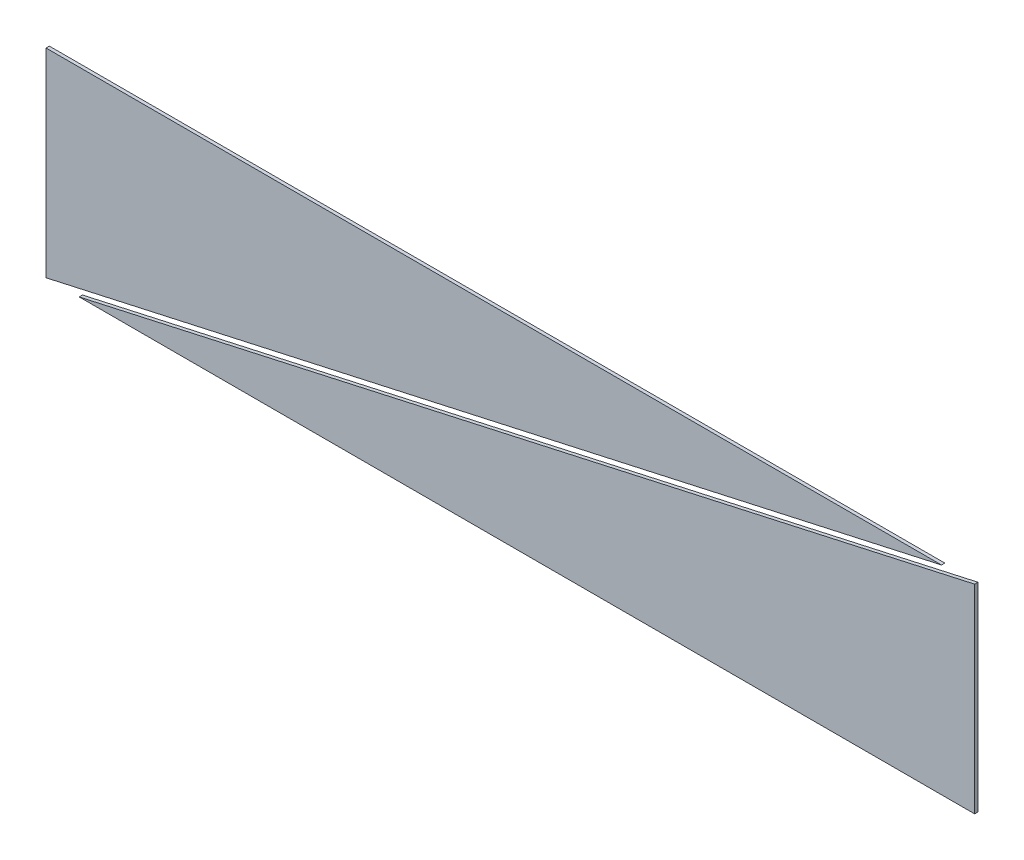
ISO-10303-21;
HEADER;
FILE_DESCRIPTION(('STEP AP214'),'2;1');
FILE_NAME('part.step','',(''),(''),'','','');
FILE_SCHEMA(('AUTOMOTIVE_DESIGN { 1 0 10303 214 1 1 1 1 }'));
ENDSEC;
DATA;
#1=APPLICATION_CONTEXT('core data for automotive mechanical design processes');
#2=APPLICATION_PROTOCOL_DEFINITION('international standard','automotive_design',2000,#1);
#3=PRODUCT_CONTEXT('',#1,'mechanical');
#4=PRODUCT('Part','Part','',(#3));
#5=PRODUCT_RELATED_PRODUCT_CATEGORY('part','',(#4));
#6=PRODUCT_DEFINITION_FORMATION('','',#4);
#7=PRODUCT_DEFINITION_CONTEXT('part definition',#1,'design');
#8=PRODUCT_DEFINITION('design','',#6,#7);
#9=PRODUCT_DEFINITION_SHAPE('','',#8);
#10=(LENGTH_UNIT() NAMED_UNIT(*) SI_UNIT(.MILLI.,.METRE.));
#11=(NAMED_UNIT(*) PLANE_ANGLE_UNIT() SI_UNIT($,.RADIAN.));
#12=(NAMED_UNIT(*) SI_UNIT($,.STERADIAN.) SOLID_ANGLE_UNIT());
#13=UNCERTAINTY_MEASURE_WITH_UNIT(LENGTH_MEASURE(1.E-05),#10,'distance_accuracy_value','');
#14=(GEOMETRIC_REPRESENTATION_CONTEXT(3) GLOBAL_UNCERTAINTY_ASSIGNED_CONTEXT((#13)) GLOBAL_UNIT_ASSIGNED_CONTEXT((#10,
#11,#12)) REPRESENTATION_CONTEXT('',''));
#15=CARTESIAN_POINT('',(0.,0.,0.));
#16=DIRECTION('',(0.,0.,1.));
#17=DIRECTION('',(1.,0.,0.));
#18=AXIS2_PLACEMENT_3D('',#15,#16,#17);
#19=CARTESIAN_POINT('',(35.,7.5,0.25));
#20=DIRECTION('',(0.216930457818656,-0.976187060183953,0.));
#21=DIRECTION('',(0.976187060183953,0.216930457818656,0.));
#22=AXIS2_PLACEMENT_3D('',#19,#20,#21);
#23=PLANE('',#22);
#24=DIRECTION('',(-0.976187060183953,-0.216930457818656,0.));
#25=VECTOR('',#24,1.);
#26=CARTESIAN_POINT('',(35.,7.5,0.));
#27=LINE('',#26,#25);
#28=CARTESIAN_POINT('',(35.,7.5,0.));
#29=VERTEX_POINT('',#28);
#30=CARTESIAN_POINT('',(-32.5,-7.5,0.));
#31=VERTEX_POINT('',#30);
#32=EDGE_CURVE('E90',#29,#31,#27,.T.);
#33=ORIENTED_EDGE('',*,*,#32,.T.);
#34=DIRECTION('',(0.,0.,-1.));
#35=VECTOR('',#34,1.);
#36=CARTESIAN_POINT('',(-32.5,-7.5,0.25));
#37=LINE('',#36,#35);
#38=CARTESIAN_POINT('',(-32.5,-7.5,0.25));
#39=VERTEX_POINT('',#38);
#40=EDGE_CURVE('E12',#39,#31,#37,.T.);
#41=ORIENTED_EDGE('',*,*,#40,.F.);
#42=DIRECTION('',(-0.976187060183953,-0.216930457818656,0.));
#43=VECTOR('',#42,1.);
#44=CARTESIAN_POINT('',(35.,7.5,0.25));
#45=LINE('',#44,#43);
#46=CARTESIAN_POINT('',(35.,7.5,0.25));
#47=VERTEX_POINT('',#46);
#48=EDGE_CURVE('E83',#47,#39,#45,.T.);
#49=ORIENTED_EDGE('',*,*,#48,.F.);
#50=DIRECTION('',(0.,0.,-1.));
#51=VECTOR('',#50,1.);
#52=CARTESIAN_POINT('',(35.,7.5,0.25));
#53=LINE('',#52,#51);
#54=EDGE_CURVE('E91',#47,#29,#53,.T.);
#55=ORIENTED_EDGE('',*,*,#54,.T.);
#56=EDGE_LOOP('',(#33,#41,#49,#55));
#57=FACE_BOUND('',#56,.T.);
#58=ADVANCED_FACE('F43',(#57),#23,.F.);
#59=CARTESIAN_POINT('',(-32.5,-7.5,0.25));
#60=DIRECTION('',(0.,1.,0.));
#61=DIRECTION('',(-1.,0.,0.));
#62=AXIS2_PLACEMENT_3D('',#59,#60,#61);
#63=PLANE('',#62);
#64=DIRECTION('',(1.,0.,0.));
#65=VECTOR('',#64,1.);
#66=CARTESIAN_POINT('',(-32.5,-7.5,0.));
#67=LINE('',#66,#65);
#68=CARTESIAN_POINT('',(35.,-7.50000000000001,0.));
#69=VERTEX_POINT('',#68);
#70=EDGE_CURVE('E71',#31,#69,#67,.T.);
#71=ORIENTED_EDGE('',*,*,#70,.T.);
#72=DIRECTION('',(0.,0.,-1.));
#73=VECTOR('',#72,1.);
#74=CARTESIAN_POINT('',(35.,-7.50000000000001,0.25));
#75=LINE('',#74,#73);
#76=CARTESIAN_POINT('',(35.,-7.50000000000001,0.25));
#77=VERTEX_POINT('',#76);
#78=EDGE_CURVE('E51',#77,#69,#75,.T.);
#79=ORIENTED_EDGE('',*,*,#78,.F.);
#80=DIRECTION('',(1.,0.,0.));
#81=VECTOR('',#80,1.);
#82=CARTESIAN_POINT('',(-32.5,-7.5,0.25));
#83=LINE('',#82,#81);
#84=EDGE_CURVE('E79',#39,#77,#83,.T.);
#85=ORIENTED_EDGE('',*,*,#84,.F.);
#86=ORIENTED_EDGE('',*,*,#40,.T.);
#87=EDGE_LOOP('',(#71,#79,#85,#86));
#88=FACE_BOUND('',#87,.T.);
#89=ADVANCED_FACE('F80',(#88),#63,.F.);
#90=CARTESIAN_POINT('',(35.,-7.50000000000001,0.25));
#91=DIRECTION('',(-1.,0.,0.));
#92=DIRECTION('',(0.,-1.,0.));
#93=AXIS2_PLACEMENT_3D('',#90,#91,#92);
#94=PLANE('',#93);
#95=DIRECTION('',(0.,1.,0.));
#96=VECTOR('',#95,1.);
#97=CARTESIAN_POINT('',(35.,-7.50000000000001,0.));
#98=LINE('',#97,#96);
#99=EDGE_CURVE('E76',#69,#29,#98,.T.);
#100=ORIENTED_EDGE('',*,*,#99,.T.);
#101=ORIENTED_EDGE('',*,*,#54,.F.);
#102=DIRECTION('',(0.,1.,0.));
#103=VECTOR('',#102,1.);
#104=CARTESIAN_POINT('',(35.,-7.50000000000001,0.25));
#105=LINE('',#104,#103);
#106=EDGE_CURVE('E59',#77,#47,#105,.T.);
#107=ORIENTED_EDGE('',*,*,#106,.F.);
#108=ORIENTED_EDGE('',*,*,#78,.T.);
#109=EDGE_LOOP('',(#100,#101,#107,#108));
#110=FACE_BOUND('',#109,.T.);
#111=ADVANCED_FACE('F98',(#110),#94,.F.);
#112=CARTESIAN_POINT('',(0.,0.,0.25));
#113=DIRECTION('',(0.,0.,-1.));
#114=DIRECTION('',(-1.,0.,0.));
#115=AXIS2_PLACEMENT_3D('',#112,#113,#114);
#116=PLANE('',#115);
#117=ORIENTED_EDGE('',*,*,#48,.T.);
#118=ORIENTED_EDGE('',*,*,#84,.T.);
#119=ORIENTED_EDGE('',*,*,#106,.T.);
#120=EDGE_LOOP('',(#117,#118,#119));
#121=FACE_BOUND('',#120,.T.);
#122=ADVANCED_FACE('F86',(#121),#116,.F.);
#123=CARTESIAN_POINT('',(0.,0.,0.));
#124=DIRECTION('',(0.,0.,-1.));
#125=DIRECTION('',(-1.,0.,0.));
#126=AXIS2_PLACEMENT_3D('',#123,#124,#125);
#127=PLANE('',#126);
#128=ORIENTED_EDGE('',*,*,#32,.F.);
#129=ORIENTED_EDGE('',*,*,#99,.F.);
#130=ORIENTED_EDGE('',*,*,#70,.F.);
#131=EDGE_LOOP('',(#128,#129,#130));
#132=FACE_BOUND('',#131,.T.);
#133=ADVANCED_FACE('F99',(#132),#127,.T.);
#134=CLOSED_SHELL('',(#58,#89,#111,#122,#133));
#135=MANIFOLD_SOLID_BREP('B2',#134);
#136=CARTESIAN_POINT('',(-35.,7.5,0.25));
#137=DIRECTION('',(1.,0.,0.));
#138=DIRECTION('',(0.,0.,-1.));
#139=AXIS2_PLACEMENT_3D('',#136,#137,#138);
#140=PLANE('',#139);
#141=DIRECTION('',(0.,-1.,0.));
#142=VECTOR('',#141,1.);
#143=CARTESIAN_POINT('',(-35.,7.5,0.));
#144=LINE('',#143,#142);
#145=CARTESIAN_POINT('',(-35.,7.5,0.));
#146=VERTEX_POINT('',#145);
#147=CARTESIAN_POINT('',(-35.,-7.5,0.));
#148=VERTEX_POINT('',#147);
#149=EDGE_CURVE('E188',#146,#148,#144,.T.);
#150=ORIENTED_EDGE('',*,*,#149,.T.);
#151=DIRECTION('',(0.,0.,-1.));
#152=VECTOR('',#151,1.);
#153=CARTESIAN_POINT('',(-35.,-7.5,0.25));
#154=LINE('',#153,#152);
#155=CARTESIAN_POINT('',(-35.,-7.5,0.25));
#156=VERTEX_POINT('',#155);
#157=EDGE_CURVE('E41',#156,#148,#154,.T.);
#158=ORIENTED_EDGE('',*,*,#157,.F.);
#159=DIRECTION('',(0.,-1.,0.));
#160=VECTOR('',#159,1.);
#161=CARTESIAN_POINT('',(-35.,7.5,0.25));
#162=LINE('',#161,#160);
#163=CARTESIAN_POINT('',(-35.,7.5,0.25));
#164=VERTEX_POINT('',#163);
#165=EDGE_CURVE('E181',#164,#156,#162,.T.);
#166=ORIENTED_EDGE('',*,*,#165,.F.);
#167=DIRECTION('',(0.,0.,-1.));
#168=VECTOR('',#167,1.);
#169=CARTESIAN_POINT('',(-35.,7.5,0.25));
#170=LINE('',#169,#168);
#171=EDGE_CURVE('E189',#164,#146,#170,.T.);
#172=ORIENTED_EDGE('',*,*,#171,.T.);
#173=EDGE_LOOP('',(#150,#158,#166,#172));
#174=FACE_BOUND('',#173,.T.);
#175=ADVANCED_FACE('F141',(#174),#140,.F.);
#176=CARTESIAN_POINT('',(32.5,7.5,0.25));
#177=DIRECTION('',(-0.216930457818656,0.976187060183953,0.));
#178=DIRECTION('',(-0.976187060183953,-0.216930457818656,0.));
#179=AXIS2_PLACEMENT_3D('',#176,#177,#178);
#180=PLANE('',#179);
#181=DIRECTION('',(0.976187060183953,0.216930457818656,0.));
#182=VECTOR('',#181,1.);
#183=CARTESIAN_POINT('',(32.5,7.5,0.));
#184=LINE('',#183,#182);
#185=CARTESIAN_POINT('',(32.5,7.5,0.));
#186=VERTEX_POINT('',#185);
#187=EDGE_CURVE('E169',#148,#186,#184,.T.);
#188=ORIENTED_EDGE('',*,*,#187,.T.);
#189=DIRECTION('',(0.,0.,-1.));
#190=VECTOR('',#189,1.);
#191=CARTESIAN_POINT('',(32.5,7.5,0.25));
#192=LINE('',#191,#190);
#193=CARTESIAN_POINT('',(32.5,7.5,0.25));
#194=VERTEX_POINT('',#193);
#195=EDGE_CURVE('E149',#194,#186,#192,.T.);
#196=ORIENTED_EDGE('',*,*,#195,.F.);
#197=DIRECTION('',(0.976187060183953,0.216930457818656,0.));
#198=VECTOR('',#197,1.);
#199=CARTESIAN_POINT('',(32.5,7.5,0.25));
#200=LINE('',#199,#198);
#201=EDGE_CURVE('E177',#156,#194,#200,.T.);
#202=ORIENTED_EDGE('',*,*,#201,.F.);
#203=ORIENTED_EDGE('',*,*,#157,.T.);
#204=EDGE_LOOP('',(#188,#196,#202,#203));
#205=FACE_BOUND('',#204,.T.);
#206=ADVANCED_FACE('F178',(#205),#180,.F.);
#207=CARTESIAN_POINT('',(-35.,7.5,0.25));
#208=DIRECTION('',(0.,-1.,0.));
#209=DIRECTION('',(0.,0.,-1.));
#210=AXIS2_PLACEMENT_3D('',#207,#208,#209);
#211=PLANE('',#210);
#212=DIRECTION('',(-1.,0.,0.));
#213=VECTOR('',#212,1.);
#214=CARTESIAN_POINT('',(-35.,7.5,0.));
#215=LINE('',#214,#213);
#216=EDGE_CURVE('E174',#186,#146,#215,.T.);
#217=ORIENTED_EDGE('',*,*,#216,.T.);
#218=ORIENTED_EDGE('',*,*,#171,.F.);
#219=DIRECTION('',(-1.,0.,0.));
#220=VECTOR('',#219,1.);
#221=CARTESIAN_POINT('',(-35.,7.5,0.25));
#222=LINE('',#221,#220);
#223=EDGE_CURVE('E157',#194,#164,#222,.T.);
#224=ORIENTED_EDGE('',*,*,#223,.F.);
#225=ORIENTED_EDGE('',*,*,#195,.T.);
#226=EDGE_LOOP('',(#217,#218,#224,#225));
#227=FACE_BOUND('',#226,.T.);
#228=ADVANCED_FACE('F196',(#227),#211,.F.);
#229=CARTESIAN_POINT('',(0.,0.,0.25));
#230=DIRECTION('',(0.,0.,1.));
#231=DIRECTION('',(1.,0.,0.));
#232=AXIS2_PLACEMENT_3D('',#229,#230,#231);
#233=PLANE('',#232);
#234=ORIENTED_EDGE('',*,*,#165,.T.);
#235=ORIENTED_EDGE('',*,*,#201,.T.);
#236=ORIENTED_EDGE('',*,*,#223,.T.);
#237=EDGE_LOOP('',(#234,#235,#236));
#238=FACE_BOUND('',#237,.T.);
#239=ADVANCED_FACE('F184',(#238),#233,.T.);
#240=CARTESIAN_POINT('',(0.,0.,0.));
#241=DIRECTION('',(0.,0.,1.));
#242=DIRECTION('',(1.,0.,0.));
#243=AXIS2_PLACEMENT_3D('',#240,#241,#242);
#244=PLANE('',#243);
#245=ORIENTED_EDGE('',*,*,#149,.F.);
#246=ORIENTED_EDGE('',*,*,#216,.F.);
#247=ORIENTED_EDGE('',*,*,#187,.F.);
#248=EDGE_LOOP('',(#245,#246,#247));
#249=FACE_BOUND('',#248,.T.);
#250=ADVANCED_FACE('F197',(#249),#244,.F.);
#251=CLOSED_SHELL('',(#175,#206,#228,#239,#250));
#252=MANIFOLD_SOLID_BREP('B6',#251);
#253=ADVANCED_BREP_SHAPE_REPRESENTATION('',(#18,#135,#252),#14);
#254=SHAPE_DEFINITION_REPRESENTATION(#9,#253);
ENDSEC;
END-ISO-10303-21;
